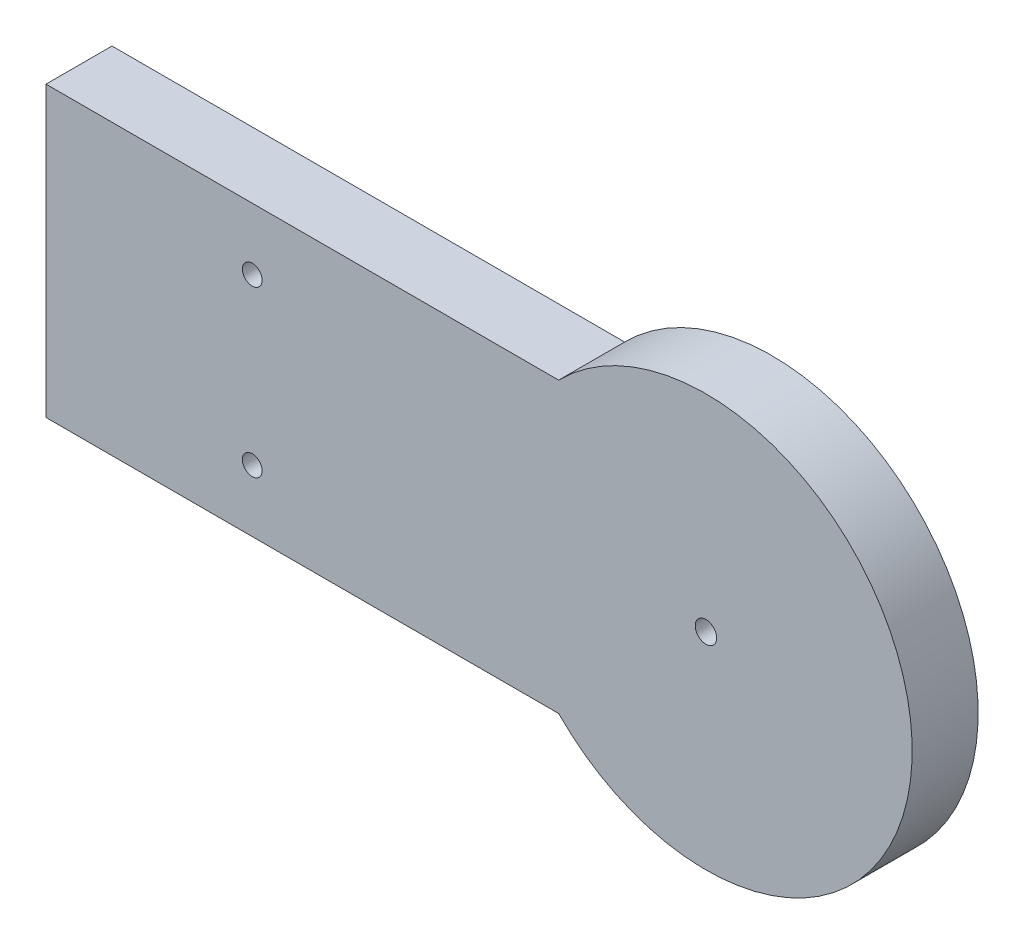
ISO-10303-21;
HEADER;
FILE_DESCRIPTION(('STEP AP214'),'2;1');
FILE_NAME('part.step','',(''),(''),'','','');
FILE_SCHEMA(('AUTOMOTIVE_DESIGN { 1 0 10303 214 1 1 1 1 }'));
ENDSEC;
DATA;
#1=APPLICATION_CONTEXT('core data for automotive mechanical design processes');
#2=APPLICATION_PROTOCOL_DEFINITION('international standard','automotive_design',2000,#1);
#3=PRODUCT_CONTEXT('',#1,'mechanical');
#4=PRODUCT('Part','Part','',(#3));
#5=PRODUCT_RELATED_PRODUCT_CATEGORY('part','',(#4));
#6=PRODUCT_DEFINITION_FORMATION('','',#4);
#7=PRODUCT_DEFINITION_CONTEXT('part definition',#1,'design');
#8=PRODUCT_DEFINITION('design','',#6,#7);
#9=PRODUCT_DEFINITION_SHAPE('','',#8);
#10=(LENGTH_UNIT() NAMED_UNIT(*) SI_UNIT(.MILLI.,.METRE.));
#11=(NAMED_UNIT(*) PLANE_ANGLE_UNIT() SI_UNIT($,.RADIAN.));
#12=(NAMED_UNIT(*) SI_UNIT($,.STERADIAN.) SOLID_ANGLE_UNIT());
#13=UNCERTAINTY_MEASURE_WITH_UNIT(LENGTH_MEASURE(1.E-05),#10,'distance_accuracy_value','');
#14=(GEOMETRIC_REPRESENTATION_CONTEXT(3) GLOBAL_UNCERTAINTY_ASSIGNED_CONTEXT((#13)) GLOBAL_UNIT_ASSIGNED_CONTEXT((#10,
#11,#12)) REPRESENTATION_CONTEXT('',''));
#15=CARTESIAN_POINT('',(0.,0.,0.));
#16=DIRECTION('',(0.,0.,1.));
#17=DIRECTION('',(1.,0.,0.));
#18=AXIS2_PLACEMENT_3D('',#15,#16,#17);
#19=CARTESIAN_POINT('',(0.,0.,8.));
#20=DIRECTION('',(0.,0.,1.));
#21=DIRECTION('',(1.,0.,0.));
#22=AXIS2_PLACEMENT_3D('',#19,#20,#21);
#23=PLANE('',#22);
#24=DIRECTION('',(0.,1.,0.));
#25=VECTOR('',#24,1.);
#26=CARTESIAN_POINT('',(120.,0.,8.));
#27=LINE('',#26,#25);
#28=CARTESIAN_POINT('',(120.,-17.5,8.));
#29=VERTEX_POINT('',#28);
#30=CARTESIAN_POINT('',(120.,17.5,8.));
#31=VERTEX_POINT('',#30);
#32=EDGE_CURVE('E66',#29,#31,#27,.T.);
#33=ORIENTED_EDGE('',*,*,#32,.F.);
#34=DIRECTION('',(1.,0.,0.));
#35=VECTOR('',#34,1.);
#36=CARTESIAN_POINT('',(17.8535710713571,-17.5,8.));
#37=LINE('',#36,#35);
#38=CARTESIAN_POINT('',(182.146428928643,-17.5,8.));
#39=VERTEX_POINT('',#38);
#40=EDGE_CURVE('E201',#29,#39,#37,.T.);
#41=ORIENTED_EDGE('',*,*,#40,.T.);
#42=CARTESIAN_POINT('',(200.,0.,8.));
#43=DIRECTION('',(0.,0.,1.));
#44=DIRECTION('',(1.,0.,0.));
#45=AXIS2_PLACEMENT_3D('',#42,#43,#44);
#46=CIRCLE('',#45,25.);
#47=CARTESIAN_POINT('',(182.146428928643,17.5,8.));
#48=VERTEX_POINT('',#47);
#49=EDGE_CURVE('E205',#39,#48,#46,.T.);
#50=ORIENTED_EDGE('',*,*,#49,.T.);
#51=DIRECTION('',(-1.,0.,0.));
#52=VECTOR('',#51,1.);
#53=CARTESIAN_POINT('',(17.8535710713571,17.5,8.));
#54=LINE('',#53,#52);
#55=EDGE_CURVE('E208',#48,#31,#54,.T.);
#56=ORIENTED_EDGE('',*,*,#55,.T.);
#57=EDGE_LOOP('',(#33,#41,#50,#56));
#58=FACE_BOUND('',#57,.T.);
#59=CARTESIAN_POINT('',(145.,-10.,8.));
#60=DIRECTION('',(0.,0.,-1.));
#61=DIRECTION('',(-1.,0.,0.));
#62=AXIS2_PLACEMENT_3D('',#59,#60,#61);
#63=CIRCLE('',#62,1.20000000000001);
#64=CARTESIAN_POINT('',(143.8,-10.,8.));
#65=VERTEX_POINT('',#64);
#66=EDGE_CURVE('E159',#65,#65,#63,.T.);
#67=ORIENTED_EDGE('',*,*,#66,.T.);
#68=EDGE_LOOP('',(#67));
#69=FACE_BOUND('',#68,.T.);
#70=CARTESIAN_POINT('',(145.,9.99999999999998,8.));
#71=DIRECTION('',(0.,0.,-1.));
#72=DIRECTION('',(-1.,0.,0.));
#73=AXIS2_PLACEMENT_3D('',#70,#71,#72);
#74=CIRCLE('',#73,1.20000000000001);
#75=CARTESIAN_POINT('',(143.8,9.99999999999998,8.));
#76=VERTEX_POINT('',#75);
#77=EDGE_CURVE('E167',#76,#76,#74,.T.);
#78=ORIENTED_EDGE('',*,*,#77,.T.);
#79=EDGE_LOOP('',(#78));
#80=FACE_BOUND('',#79,.T.);
#81=CARTESIAN_POINT('',(200.,0.,8.));
#82=DIRECTION('',(0.,0.,1.));
#83=DIRECTION('',(1.,0.,0.));
#84=AXIS2_PLACEMENT_3D('',#81,#82,#83);
#85=CIRCLE('',#84,1.3);
#86=CARTESIAN_POINT('',(201.3,0.,8.));
#87=VERTEX_POINT('',#86);
#88=EDGE_CURVE('E127',#87,#87,#85,.T.);
#89=ORIENTED_EDGE('',*,*,#88,.F.);
#90=EDGE_LOOP('',(#89));
#91=FACE_BOUND('',#90,.T.);
#92=ADVANCED_FACE('F51',(#58,#69,#80,#91),#23,.T.);
#93=CARTESIAN_POINT('',(0.,0.,5.));
#94=DIRECTION('',(0.,0.,1.));
#95=DIRECTION('',(1.,0.,0.));
#96=AXIS2_PLACEMENT_3D('',#93,#94,#95);
#97=PLANE('',#96);
#98=CARTESIAN_POINT('',(145.,-10.,5.));
#99=DIRECTION('',(0.,0.,-1.));
#100=DIRECTION('',(-1.,0.,0.));
#101=AXIS2_PLACEMENT_3D('',#98,#99,#100);
#102=CIRCLE('',#101,1.20000000000001);
#103=CARTESIAN_POINT('',(143.8,-10.,5.));
#104=VERTEX_POINT('',#103);
#105=EDGE_CURVE('E152',#104,#104,#102,.T.);
#106=ORIENTED_EDGE('',*,*,#105,.F.);
#107=EDGE_LOOP('',(#106));
#108=FACE_BOUND('',#107,.T.);
#109=CARTESIAN_POINT('',(145.,9.99999999999998,5.));
#110=DIRECTION('',(0.,0.,-1.));
#111=DIRECTION('',(-1.,0.,0.));
#112=AXIS2_PLACEMENT_3D('',#109,#110,#111);
#113=CIRCLE('',#112,1.20000000000001);
#114=CARTESIAN_POINT('',(143.8,9.99999999999998,5.));
#115=VERTEX_POINT('',#114);
#116=EDGE_CURVE('E164',#115,#115,#113,.T.);
#117=ORIENTED_EDGE('',*,*,#116,.F.);
#118=EDGE_LOOP('',(#117));
#119=FACE_BOUND('',#118,.T.);
#120=DIRECTION('',(1.,0.,0.));
#121=VECTOR('',#120,1.);
#122=CARTESIAN_POINT('',(17.8535710713571,-14.5,5.));
#123=LINE('',#122,#121);
#124=CARTESIAN_POINT('',(120.,-14.5,5.));
#125=VERTEX_POINT('',#124);
#126=CARTESIAN_POINT('',(180.875408501095,-14.5,5.));
#127=VERTEX_POINT('',#126);
#128=EDGE_CURVE('E134',#125,#127,#123,.T.);
#129=ORIENTED_EDGE('',*,*,#128,.F.);
#130=DIRECTION('',(0.,1.,0.));
#131=VECTOR('',#130,1.);
#132=CARTESIAN_POINT('',(120.,0.,5.));
#133=LINE('',#132,#131);
#134=CARTESIAN_POINT('',(120.,14.5,5.));
#135=VERTEX_POINT('',#134);
#136=EDGE_CURVE('E132',#125,#135,#133,.T.);
#137=ORIENTED_EDGE('',*,*,#136,.T.);
#138=DIRECTION('',(-1.,0.,0.));
#139=VECTOR('',#138,1.);
#140=CARTESIAN_POINT('',(17.8535710713571,14.5,5.));
#141=LINE('',#140,#139);
#142=CARTESIAN_POINT('',(180.875408501095,14.5,5.));
#143=VERTEX_POINT('',#142);
#144=EDGE_CURVE('E118',#143,#135,#141,.T.);
#145=ORIENTED_EDGE('',*,*,#144,.F.);
#146=CARTESIAN_POINT('',(200.,0.,5.));
#147=DIRECTION('',(0.,0.,1.));
#148=DIRECTION('',(1.,0.,0.));
#149=AXIS2_PLACEMENT_3D('',#146,#147,#148);
#150=CIRCLE('',#149,24.);
#151=EDGE_CURVE('E172',#127,#143,#150,.F.);
#152=ORIENTED_EDGE('',*,*,#151,.F.);
#153=EDGE_LOOP('',(#129,#137,#145,#152));
#154=FACE_BOUND('',#153,.T.);
#155=ADVANCED_FACE('F133',(#108,#119,#154),#97,.F.);
#156=CARTESIAN_POINT('',(200.,0.,5.));
#157=DIRECTION('',(0.,0.,1.));
#158=DIRECTION('',(1.,0.,0.));
#159=AXIS2_PLACEMENT_3D('',#156,#157,#158);
#160=CIRCLE('',#159,4.3);
#161=CARTESIAN_POINT('',(204.3,0.,5.));
#162=VERTEX_POINT('',#161);
#163=EDGE_CURVE('E177',#162,#162,#160,.T.);
#164=ORIENTED_EDGE('',*,*,#163,.T.);
#165=EDGE_LOOP('',(#164));
#166=FACE_BOUND('',#165,.T.);
#167=CARTESIAN_POINT('',(200.,0.,5.));
#168=DIRECTION('',(0.,0.,1.));
#169=DIRECTION('',(1.,0.,0.));
#170=AXIS2_PLACEMENT_3D('',#167,#168,#169);
#171=CIRCLE('',#170,22.);
#172=CARTESIAN_POINT('',(222.,0.,5.));
#173=VERTEX_POINT('',#172);
#174=EDGE_CURVE('E128',#173,#173,#171,.T.);
#175=ORIENTED_EDGE('',*,*,#174,.F.);
#176=EDGE_LOOP('',(#175));
#177=FACE_BOUND('',#176,.T.);
#178=ADVANCED_FACE('F235',(#166,#177),#97,.F.);
#179=CARTESIAN_POINT('',(0.,0.,0.));
#180=DIRECTION('',(0.,0.,1.));
#181=DIRECTION('',(1.,0.,0.));
#182=AXIS2_PLACEMENT_3D('',#179,#180,#181);
#183=PLANE('',#182);
#184=CARTESIAN_POINT('',(200.,0.,0.));
#185=DIRECTION('',(0.,0.,1.));
#186=DIRECTION('',(1.,0.,0.));
#187=AXIS2_PLACEMENT_3D('',#184,#185,#186);
#188=CIRCLE('',#187,1.3);
#189=CARTESIAN_POINT('',(201.3,0.,0.));
#190=VERTEX_POINT('',#189);
#191=EDGE_CURVE('E198',#190,#190,#188,.T.);
#192=ORIENTED_EDGE('',*,*,#191,.T.);
#193=EDGE_LOOP('',(#192));
#194=FACE_BOUND('',#193,.T.);
#195=CARTESIAN_POINT('',(200.,0.,0.));
#196=DIRECTION('',(0.,0.,1.));
#197=DIRECTION('',(1.,0.,0.));
#198=AXIS2_PLACEMENT_3D('',#195,#196,#197);
#199=CIRCLE('',#198,4.3);
#200=CARTESIAN_POINT('',(204.3,0.,0.));
#201=VERTEX_POINT('',#200);
#202=EDGE_CURVE('E187',#201,#201,#199,.T.);
#203=ORIENTED_EDGE('',*,*,#202,.F.);
#204=EDGE_LOOP('',(#203));
#205=FACE_BOUND('',#204,.T.);
#206=ADVANCED_FACE('F230',(#194,#205),#183,.F.);
#207=CARTESIAN_POINT('',(17.8535710713571,-17.5,8.));
#208=DIRECTION('',(0.,1.,0.));
#209=DIRECTION('',(0.,0.,1.));
#210=AXIS2_PLACEMENT_3D('',#207,#208,#209);
#211=PLANE('',#210);
#212=ORIENTED_EDGE('',*,*,#40,.F.);
#213=DIRECTION('',(0.,0.,-1.));
#214=VECTOR('',#213,1.);
#215=CARTESIAN_POINT('',(120.,-17.5,8.));
#216=LINE('',#215,#214);
#217=CARTESIAN_POINT('',(120.,-17.5,0.));
#218=VERTEX_POINT('',#217);
#219=EDGE_CURVE('E147',#29,#218,#216,.T.);
#220=ORIENTED_EDGE('',*,*,#219,.T.);
#221=DIRECTION('',(1.,0.,0.));
#222=VECTOR('',#221,1.);
#223=CARTESIAN_POINT('',(17.8535710713571,-17.5,0.));
#224=LINE('',#223,#222);
#225=CARTESIAN_POINT('',(182.146428928643,-17.5,0.));
#226=VERTEX_POINT('',#225);
#227=EDGE_CURVE('E200',#218,#226,#224,.T.);
#228=ORIENTED_EDGE('',*,*,#227,.T.);
#229=DIRECTION('',(0.,0.,-1.));
#230=VECTOR('',#229,1.);
#231=CARTESIAN_POINT('',(182.146428928643,-17.5,8.));
#232=LINE('',#231,#230);
#233=EDGE_CURVE('E59',#39,#226,#232,.T.);
#234=ORIENTED_EDGE('',*,*,#233,.F.);
#235=EDGE_LOOP('',(#212,#220,#228,#234));
#236=FACE_BOUND('',#235,.T.);
#237=ADVANCED_FACE('F53',(#236),#211,.F.);
#238=CARTESIAN_POINT('',(200.,0.,8.));
#239=DIRECTION('',(0.,0.,-1.));
#240=DIRECTION('',(-1.,0.,0.));
#241=AXIS2_PLACEMENT_3D('',#238,#239,#240);
#242=CYLINDRICAL_SURFACE('',#241,25.);
#243=CARTESIAN_POINT('',(200.,0.,0.));
#244=DIRECTION('',(0.,0.,1.));
#245=DIRECTION('',(1.,0.,0.));
#246=AXIS2_PLACEMENT_3D('',#243,#244,#245);
#247=CIRCLE('',#246,25.);
#248=CARTESIAN_POINT('',(182.146428928643,17.5,0.));
#249=VERTEX_POINT('',#248);
#250=EDGE_CURVE('E213',#226,#249,#247,.T.);
#251=ORIENTED_EDGE('',*,*,#250,.T.);
#252=DIRECTION('',(0.,0.,-1.));
#253=VECTOR('',#252,1.);
#254=CARTESIAN_POINT('',(182.146428928643,17.5,8.));
#255=LINE('',#254,#253);
#256=EDGE_CURVE('E211',#48,#249,#255,.T.);
#257=ORIENTED_EDGE('',*,*,#256,.F.);
#258=ORIENTED_EDGE('',*,*,#49,.F.);
#259=ORIENTED_EDGE('',*,*,#233,.T.);
#260=EDGE_LOOP('',(#251,#257,#258,#259));
#261=FACE_BOUND('',#260,.T.);
#262=ADVANCED_FACE('F222',(#261),#242,.T.);
#263=CARTESIAN_POINT('',(17.8535710713571,17.5,8.));
#264=DIRECTION('',(0.,-1.,0.));
#265=DIRECTION('',(0.,0.,-1.));
#266=AXIS2_PLACEMENT_3D('',#263,#264,#265);
#267=PLANE('',#266);
#268=DIRECTION('',(-1.,0.,0.));
#269=VECTOR('',#268,1.);
#270=CARTESIAN_POINT('',(17.8535710713571,17.5,0.));
#271=LINE('',#270,#269);
#272=CARTESIAN_POINT('',(120.,17.5,0.));
#273=VERTEX_POINT('',#272);
#274=EDGE_CURVE('E206',#249,#273,#271,.T.);
#275=ORIENTED_EDGE('',*,*,#274,.T.);
#276=DIRECTION('',(0.,0.,1.));
#277=VECTOR('',#276,1.);
#278=CARTESIAN_POINT('',(120.,17.5,8.));
#279=LINE('',#278,#277);
#280=EDGE_CURVE('E74',#273,#31,#279,.T.);
#281=ORIENTED_EDGE('',*,*,#280,.T.);
#282=ORIENTED_EDGE('',*,*,#55,.F.);
#283=ORIENTED_EDGE('',*,*,#256,.T.);
#284=EDGE_LOOP('',(#275,#281,#282,#283));
#285=FACE_BOUND('',#284,.T.);
#286=ADVANCED_FACE('F227',(#285),#267,.F.);
#287=ORIENTED_EDGE('',*,*,#227,.F.);
#288=DIRECTION('',(0.,1.,0.));
#289=VECTOR('',#288,1.);
#290=CARTESIAN_POINT('',(120.,0.,0.));
#291=LINE('',#290,#289);
#292=CARTESIAN_POINT('',(120.,-14.5,0.));
#293=VERTEX_POINT('',#292);
#294=EDGE_CURVE('E145',#218,#293,#291,.T.);
#295=ORIENTED_EDGE('',*,*,#294,.T.);
#296=DIRECTION('',(1.,0.,0.));
#297=VECTOR('',#296,1.);
#298=CARTESIAN_POINT('',(17.8535710713571,-14.5,0.));
#299=LINE('',#298,#297);
#300=CARTESIAN_POINT('',(180.875408501095,-14.5,0.));
#301=VERTEX_POINT('',#300);
#302=EDGE_CURVE('E192',#293,#301,#299,.T.);
#303=ORIENTED_EDGE('',*,*,#302,.T.);
#304=CARTESIAN_POINT('',(200.,0.,0.));
#305=DIRECTION('',(0.,0.,-1.));
#306=DIRECTION('',(-1.,0.,0.));
#307=AXIS2_PLACEMENT_3D('',#304,#305,#306);
#308=CIRCLE('',#307,24.);
#309=CARTESIAN_POINT('',(180.875408501095,14.5,0.));
#310=VERTEX_POINT('',#309);
#311=EDGE_CURVE('E175',#301,#310,#308,.T.);
#312=ORIENTED_EDGE('',*,*,#311,.T.);
#313=DIRECTION('',(-1.,0.,0.));
#314=VECTOR('',#313,1.);
#315=CARTESIAN_POINT('',(17.8535710713571,14.5,0.));
#316=LINE('',#315,#314);
#317=CARTESIAN_POINT('',(120.,14.5,0.));
#318=VERTEX_POINT('',#317);
#319=EDGE_CURVE('E182',#310,#318,#316,.T.);
#320=ORIENTED_EDGE('',*,*,#319,.T.);
#321=EDGE_CURVE('E141',#318,#273,#291,.T.);
#322=ORIENTED_EDGE('',*,*,#321,.T.);
#323=ORIENTED_EDGE('',*,*,#274,.F.);
#324=ORIENTED_EDGE('',*,*,#250,.F.);
#325=EDGE_LOOP('',(#287,#295,#303,#312,#320,#322,#323,#324));
#326=FACE_BOUND('',#325,.T.);
#327=CARTESIAN_POINT('',(200.,0.,0.));
#328=DIRECTION('',(0.,0.,1.));
#329=DIRECTION('',(1.,0.,0.));
#330=AXIS2_PLACEMENT_3D('',#327,#328,#329);
#331=CIRCLE('',#330,22.);
#332=CARTESIAN_POINT('',(222.,0.,0.));
#333=VERTEX_POINT('',#332);
#334=EDGE_CURVE('E189',#333,#333,#331,.T.);
#335=ORIENTED_EDGE('',*,*,#334,.T.);
#336=EDGE_LOOP('',(#335));
#337=FACE_BOUND('',#336,.T.);
#338=ADVANCED_FACE('F225',(#326,#337),#183,.F.);
#339=CARTESIAN_POINT('',(200.,0.,8.));
#340=DIRECTION('',(0.,0.,1.));
#341=DIRECTION('',(1.,0.,0.));
#342=AXIS2_PLACEMENT_3D('',#339,#340,#341);
#343=CYLINDRICAL_SURFACE('',#342,1.3);
#344=ORIENTED_EDGE('',*,*,#191,.F.);
#345=EDGE_LOOP('',(#344));
#346=FACE_BOUND('',#345,.T.);
#347=ORIENTED_EDGE('',*,*,#88,.T.);
#348=EDGE_LOOP('',(#347));
#349=FACE_BOUND('',#348,.T.);
#350=ADVANCED_FACE('F246',(#346,#349),#343,.F.);
#351=CARTESIAN_POINT('',(17.8535710713571,-14.5,8.));
#352=DIRECTION('',(0.,1.,0.));
#353=DIRECTION('',(0.,0.,1.));
#354=AXIS2_PLACEMENT_3D('',#351,#352,#353);
#355=PLANE('',#354);
#356=DIRECTION('',(0.,0.,-1.));
#357=VECTOR('',#356,1.);
#358=CARTESIAN_POINT('',(120.,-14.5,8.));
#359=LINE('',#358,#357);
#360=EDGE_CURVE('E148',#125,#293,#359,.T.);
#361=ORIENTED_EDGE('',*,*,#360,.F.);
#362=ORIENTED_EDGE('',*,*,#128,.T.);
#363=DIRECTION('',(0.,0.,-1.));
#364=VECTOR('',#363,1.);
#365=CARTESIAN_POINT('',(180.875408501095,-14.5,8.002));
#366=LINE('',#365,#364);
#367=EDGE_CURVE('E174',#127,#301,#366,.T.);
#368=ORIENTED_EDGE('',*,*,#367,.T.);
#369=ORIENTED_EDGE('',*,*,#302,.F.);
#370=EDGE_LOOP('',(#361,#362,#368,#369));
#371=FACE_BOUND('',#370,.T.);
#372=ADVANCED_FACE('F263',(#371),#355,.T.);
#373=CARTESIAN_POINT('',(200.,0.,8.));
#374=DIRECTION('',(0.,0.,-1.));
#375=DIRECTION('',(-1.,0.,0.));
#376=AXIS2_PLACEMENT_3D('',#373,#374,#375);
#377=CYLINDRICAL_SURFACE('',#376,22.);
#378=ORIENTED_EDGE('',*,*,#334,.F.);
#379=EDGE_LOOP('',(#378));
#380=FACE_BOUND('',#379,.T.);
#381=ORIENTED_EDGE('',*,*,#174,.T.);
#382=EDGE_LOOP('',(#381));
#383=FACE_BOUND('',#382,.T.);
#384=ADVANCED_FACE('F269',(#380,#383),#377,.F.);
#385=CARTESIAN_POINT('',(17.8535710713571,14.5,8.));
#386=DIRECTION('',(0.,-1.,0.));
#387=DIRECTION('',(0.,0.,-1.));
#388=AXIS2_PLACEMENT_3D('',#385,#386,#387);
#389=PLANE('',#388);
#390=DIRECTION('',(0.,0.,1.));
#391=VECTOR('',#390,1.);
#392=CARTESIAN_POINT('',(120.,14.5,8.));
#393=LINE('',#392,#391);
#394=EDGE_CURVE('E13',#318,#135,#393,.T.);
#395=ORIENTED_EDGE('',*,*,#394,.F.);
#396=ORIENTED_EDGE('',*,*,#319,.F.);
#397=DIRECTION('',(0.,0.,-1.));
#398=VECTOR('',#397,1.);
#399=CARTESIAN_POINT('',(180.875408501095,14.5,8.002));
#400=LINE('',#399,#398);
#401=EDGE_CURVE('E124',#143,#310,#400,.T.);
#402=ORIENTED_EDGE('',*,*,#401,.F.);
#403=ORIENTED_EDGE('',*,*,#144,.T.);
#404=EDGE_LOOP('',(#395,#396,#402,#403));
#405=FACE_BOUND('',#404,.T.);
#406=ADVANCED_FACE('F120',(#405),#389,.T.);
#407=CARTESIAN_POINT('',(200.,0.,8.));
#408=DIRECTION('',(0.,0.,1.));
#409=DIRECTION('',(1.,0.,0.));
#410=AXIS2_PLACEMENT_3D('',#407,#408,#409);
#411=CYLINDRICAL_SURFACE('',#410,4.3);
#412=ORIENTED_EDGE('',*,*,#202,.T.);
#413=EDGE_LOOP('',(#412));
#414=FACE_BOUND('',#413,.T.);
#415=ORIENTED_EDGE('',*,*,#163,.F.);
#416=EDGE_LOOP('',(#415));
#417=FACE_BOUND('',#416,.T.);
#418=ADVANCED_FACE('F282',(#414,#417),#411,.T.);
#419=CARTESIAN_POINT('',(200.,0.,8.002));
#420=DIRECTION('',(0.,0.,-1.));
#421=DIRECTION('',(-1.,0.,0.));
#422=AXIS2_PLACEMENT_3D('',#419,#420,#421);
#423=CYLINDRICAL_SURFACE('',#422,24.);
#424=ORIENTED_EDGE('',*,*,#367,.F.);
#425=ORIENTED_EDGE('',*,*,#151,.T.);
#426=ORIENTED_EDGE('',*,*,#401,.T.);
#427=ORIENTED_EDGE('',*,*,#311,.F.);
#428=EDGE_LOOP('',(#424,#425,#426,#427));
#429=FACE_BOUND('',#428,.T.);
#430=ADVANCED_FACE('F288',(#429),#423,.T.);
#431=CARTESIAN_POINT('',(145.,9.99999999999998,5.));
#432=DIRECTION('',(0.,0.,-1.));
#433=DIRECTION('',(-1.,0.,0.));
#434=AXIS2_PLACEMENT_3D('',#431,#432,#433);
#435=CYLINDRICAL_SURFACE('',#434,1.20000000000001);
#436=ORIENTED_EDGE('',*,*,#77,.F.);
#437=EDGE_LOOP('',(#436));
#438=FACE_BOUND('',#437,.T.);
#439=ORIENTED_EDGE('',*,*,#116,.T.);
#440=EDGE_LOOP('',(#439));
#441=FACE_BOUND('',#440,.T.);
#442=ADVANCED_FACE('F294',(#438,#441),#435,.F.);
#443=CARTESIAN_POINT('',(145.,-10.,5.));
#444=DIRECTION('',(0.,0.,-1.));
#445=DIRECTION('',(-1.,0.,0.));
#446=AXIS2_PLACEMENT_3D('',#443,#444,#445);
#447=CYLINDRICAL_SURFACE('',#446,1.20000000000001);
#448=ORIENTED_EDGE('',*,*,#66,.F.);
#449=EDGE_LOOP('',(#448));
#450=FACE_BOUND('',#449,.T.);
#451=ORIENTED_EDGE('',*,*,#105,.T.);
#452=EDGE_LOOP('',(#451));
#453=FACE_BOUND('',#452,.T.);
#454=ADVANCED_FACE('F301',(#450,#453),#447,.F.);
#455=CARTESIAN_POINT('',(120.,0.,0.));
#456=DIRECTION('',(1.,0.,0.));
#457=DIRECTION('',(0.,0.,-1.));
#458=AXIS2_PLACEMENT_3D('',#455,#456,#457);
#459=PLANE('',#458);
#460=ORIENTED_EDGE('',*,*,#219,.F.);
#461=ORIENTED_EDGE('',*,*,#32,.T.);
#462=ORIENTED_EDGE('',*,*,#280,.F.);
#463=ORIENTED_EDGE('',*,*,#321,.F.);
#464=ORIENTED_EDGE('',*,*,#394,.T.);
#465=ORIENTED_EDGE('',*,*,#136,.F.);
#466=ORIENTED_EDGE('',*,*,#360,.T.);
#467=ORIENTED_EDGE('',*,*,#294,.F.);
#468=EDGE_LOOP('',(#460,#461,#462,#463,#464,#465,#466,#467));
#469=FACE_BOUND('',#468,.T.);
#470=ADVANCED_FACE('F140',(#469),#459,.F.);
#471=CLOSED_SHELL('',(#92,#155,#178,#206,#237,#262,#286,#338,#350,#372,#384,#406,#418,#430,#442,
#454,#470));
#472=MANIFOLD_SOLID_BREP('B2',#471);
#473=ADVANCED_BREP_SHAPE_REPRESENTATION('',(#18,#472),#14);
#474=SHAPE_DEFINITION_REPRESENTATION(#9,#473);
ENDSEC;
END-ISO-10303-21;
